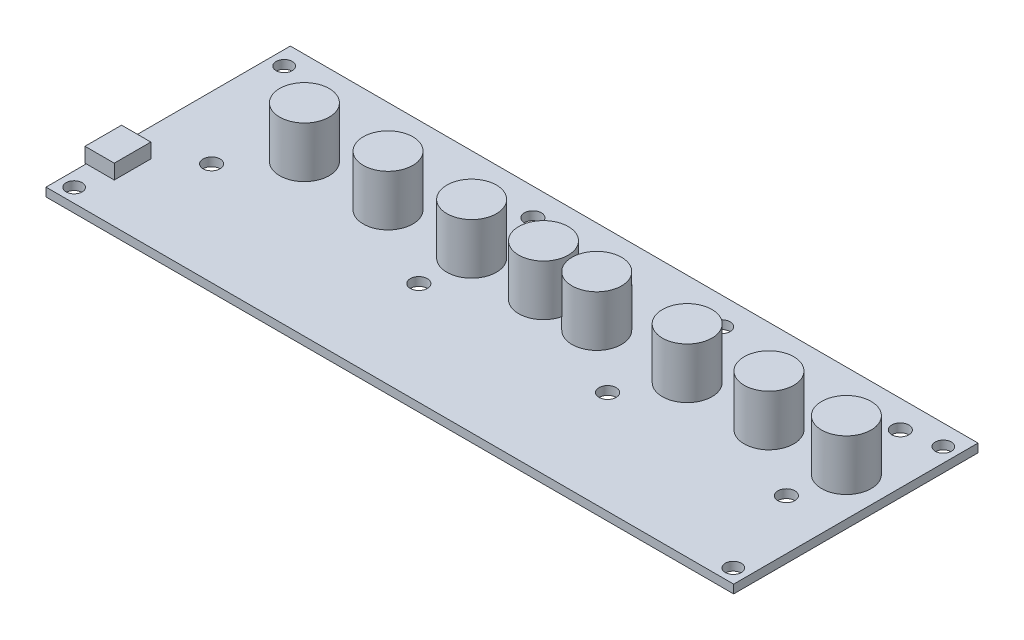
ISO-10303-21;
HEADER;
FILE_DESCRIPTION(('STEP AP214'),'2;1');
FILE_NAME('part.step','',(''),(''),'','','');
FILE_SCHEMA(('AUTOMOTIVE_DESIGN { 1 0 10303 214 1 1 1 1 }'));
ENDSEC;
DATA;
#1=APPLICATION_CONTEXT('core data for automotive mechanical design processes');
#2=APPLICATION_PROTOCOL_DEFINITION('international standard','automotive_design',2000,#1);
#3=PRODUCT_CONTEXT('',#1,'mechanical');
#4=PRODUCT('Part','Part','',(#3));
#5=PRODUCT_RELATED_PRODUCT_CATEGORY('part','',(#4));
#6=PRODUCT_DEFINITION_FORMATION('','',#4);
#7=PRODUCT_DEFINITION_CONTEXT('part definition',#1,'design');
#8=PRODUCT_DEFINITION('design','',#6,#7);
#9=PRODUCT_DEFINITION_SHAPE('','',#8);
#10=(LENGTH_UNIT() NAMED_UNIT(*) SI_UNIT(.MILLI.,.METRE.));
#11=(NAMED_UNIT(*) PLANE_ANGLE_UNIT() SI_UNIT($,.RADIAN.));
#12=(NAMED_UNIT(*) SI_UNIT($,.STERADIAN.) SOLID_ANGLE_UNIT());
#13=UNCERTAINTY_MEASURE_WITH_UNIT(LENGTH_MEASURE(1.E-05),#10,'distance_accuracy_value','');
#14=(GEOMETRIC_REPRESENTATION_CONTEXT(3) GLOBAL_UNCERTAINTY_ASSIGNED_CONTEXT((#13)) GLOBAL_UNIT_ASSIGNED_CONTEXT((#10,
#11,#12)) REPRESENTATION_CONTEXT('',''));
#15=CARTESIAN_POINT('',(0.,0.,0.));
#16=DIRECTION('',(0.,0.,1.));
#17=DIRECTION('',(1.,0.,0.));
#18=AXIS2_PLACEMENT_3D('',#15,#16,#17);
#19=CARTESIAN_POINT('',(70.5,0.875,25.05));
#20=DIRECTION('',(-1.,0.,0.));
#21=DIRECTION('',(0.,0.,1.));
#22=AXIS2_PLACEMENT_3D('',#19,#20,#21);
#23=PLANE('',#22);
#24=DIRECTION('',(0.,0.,-1.));
#25=VECTOR('',#24,1.);
#26=CARTESIAN_POINT('',(70.5,-0.875,25.05));
#27=LINE('',#26,#25);
#28=CARTESIAN_POINT('',(70.5,-0.875,25.05));
#29=VERTEX_POINT('',#28);
#30=CARTESIAN_POINT('',(70.5,-0.875,-25.05));
#31=VERTEX_POINT('',#30);
#32=EDGE_CURVE('E235',#29,#31,#27,.T.);
#33=ORIENTED_EDGE('',*,*,#32,.T.);
#34=DIRECTION('',(0.,-1.,0.));
#35=VECTOR('',#34,1.);
#36=CARTESIAN_POINT('',(70.5,0.875,-25.05));
#37=LINE('',#36,#35);
#38=CARTESIAN_POINT('',(70.5,0.875,-25.05));
#39=VERTEX_POINT('',#38);
#40=EDGE_CURVE('E261',#39,#31,#37,.T.);
#41=ORIENTED_EDGE('',*,*,#40,.F.);
#42=DIRECTION('',(0.,0.,-1.));
#43=VECTOR('',#42,1.);
#44=CARTESIAN_POINT('',(70.5,0.875,25.05));
#45=LINE('',#44,#43);
#46=CARTESIAN_POINT('',(70.5,0.875,25.05));
#47=VERTEX_POINT('',#46);
#48=EDGE_CURVE('E240',#47,#39,#45,.T.);
#49=ORIENTED_EDGE('',*,*,#48,.F.);
#50=DIRECTION('',(0.,-1.,0.));
#51=VECTOR('',#50,1.);
#52=CARTESIAN_POINT('',(70.5,0.875,25.05));
#53=LINE('',#52,#51);
#54=EDGE_CURVE('E247',#47,#29,#53,.T.);
#55=ORIENTED_EDGE('',*,*,#54,.T.);
#56=EDGE_LOOP('',(#33,#41,#49,#55));
#57=FACE_BOUND('',#56,.T.);
#58=ADVANCED_FACE('F33',(#57),#23,.F.);
#59=CARTESIAN_POINT('',(-70.5,0.875,-25.05));
#60=DIRECTION('',(0.,0.,1.));
#61=DIRECTION('',(1.,0.,0.));
#62=AXIS2_PLACEMENT_3D('',#59,#60,#61);
#63=PLANE('',#62);
#64=DIRECTION('',(-1.,0.,0.));
#65=VECTOR('',#64,1.);
#66=CARTESIAN_POINT('',(-70.5,-0.875,-25.05));
#67=LINE('',#66,#65);
#68=CARTESIAN_POINT('',(-70.5,-0.875,-25.05));
#69=VERTEX_POINT('',#68);
#70=EDGE_CURVE('E250',#31,#69,#67,.T.);
#71=ORIENTED_EDGE('',*,*,#70,.T.);
#72=DIRECTION('',(0.,-1.,0.));
#73=VECTOR('',#72,1.);
#74=CARTESIAN_POINT('',(-70.5,0.875,-25.05));
#75=LINE('',#74,#73);
#76=CARTESIAN_POINT('',(-70.5,0.875,-25.05));
#77=VERTEX_POINT('',#76);
#78=EDGE_CURVE('E258',#77,#69,#75,.T.);
#79=ORIENTED_EDGE('',*,*,#78,.F.);
#80=DIRECTION('',(-1.,0.,0.));
#81=VECTOR('',#80,1.);
#82=CARTESIAN_POINT('',(-70.5,0.875,-25.05));
#83=LINE('',#82,#81);
#84=EDGE_CURVE('E85',#39,#77,#83,.T.);
#85=ORIENTED_EDGE('',*,*,#84,.F.);
#86=ORIENTED_EDGE('',*,*,#40,.T.);
#87=EDGE_LOOP('',(#71,#79,#85,#86));
#88=FACE_BOUND('',#87,.T.);
#89=ADVANCED_FACE('F342',(#88),#63,.F.);
#90=CARTESIAN_POINT('',(-70.5,0.875,25.05));
#91=DIRECTION('',(1.,0.,0.));
#92=DIRECTION('',(0.,0.,-1.));
#93=AXIS2_PLACEMENT_3D('',#90,#91,#92);
#94=PLANE('',#93);
#95=DIRECTION('',(0.,0.,1.));
#96=VECTOR('',#95,1.);
#97=CARTESIAN_POINT('',(-70.5,-0.875,25.05));
#98=LINE('',#97,#96);
#99=CARTESIAN_POINT('',(-70.5,-0.875,25.05));
#100=VERTEX_POINT('',#99);
#101=EDGE_CURVE('E252',#69,#100,#98,.T.);
#102=ORIENTED_EDGE('',*,*,#101,.T.);
#103=DIRECTION('',(0.,-1.,0.));
#104=VECTOR('',#103,1.);
#105=CARTESIAN_POINT('',(-70.5,0.875,25.05));
#106=LINE('',#105,#104);
#107=CARTESIAN_POINT('',(-70.5,0.875,25.05));
#108=VERTEX_POINT('',#107);
#109=EDGE_CURVE('E256',#108,#100,#106,.T.);
#110=ORIENTED_EDGE('',*,*,#109,.F.);
#111=DIRECTION('',(0.,0.,1.));
#112=VECTOR('',#111,1.);
#113=CARTESIAN_POINT('',(-70.5,0.875,25.05));
#114=LINE('',#113,#112);
#115=CARTESIAN_POINT('',(-70.5,0.875,16.8));
#116=VERTEX_POINT('',#115);
#117=EDGE_CURVE('E243',#116,#108,#114,.T.);
#118=ORIENTED_EDGE('',*,*,#117,.F.);
#119=CARTESIAN_POINT('',(-70.5,0.875,9.3));
#120=VERTEX_POINT('',#119);
#121=EDGE_CURVE('E245',#120,#116,#114,.T.);
#122=ORIENTED_EDGE('',*,*,#121,.F.);
#123=EDGE_CURVE('E134',#77,#120,#114,.T.);
#124=ORIENTED_EDGE('',*,*,#123,.F.);
#125=ORIENTED_EDGE('',*,*,#78,.T.);
#126=EDGE_LOOP('',(#102,#110,#118,#122,#124,#125));
#127=FACE_BOUND('',#126,.T.);
#128=ADVANCED_FACE('F347',(#127),#94,.F.);
#129=CARTESIAN_POINT('',(-70.5,0.875,25.05));
#130=DIRECTION('',(0.,0.,-1.));
#131=DIRECTION('',(-1.,0.,0.));
#132=AXIS2_PLACEMENT_3D('',#129,#130,#131);
#133=PLANE('',#132);
#134=DIRECTION('',(1.,0.,0.));
#135=VECTOR('',#134,1.);
#136=CARTESIAN_POINT('',(-70.5,-0.875,25.05));
#137=LINE('',#136,#135);
#138=EDGE_CURVE('E77',#100,#29,#137,.T.);
#139=ORIENTED_EDGE('',*,*,#138,.T.);
#140=ORIENTED_EDGE('',*,*,#54,.F.);
#141=DIRECTION('',(1.,0.,0.));
#142=VECTOR('',#141,1.);
#143=CARTESIAN_POINT('',(-70.5,0.875,25.05));
#144=LINE('',#143,#142);
#145=EDGE_CURVE('E56',#108,#47,#144,.T.);
#146=ORIENTED_EDGE('',*,*,#145,.F.);
#147=ORIENTED_EDGE('',*,*,#109,.T.);
#148=EDGE_LOOP('',(#139,#140,#146,#147));
#149=FACE_BOUND('',#148,.T.);
#150=ADVANCED_FACE('F288',(#149),#133,.F.);
#151=CARTESIAN_POINT('',(0.,0.875,0.));
#152=DIRECTION('',(0.,-1.,0.));
#153=DIRECTION('',(0.,0.,-1.));
#154=AXIS2_PLACEMENT_3D('',#151,#152,#153);
#155=PLANE('',#154);
#156=ORIENTED_EDGE('',*,*,#123,.T.);
#157=DIRECTION('',(-1.,0.,0.));
#158=VECTOR('',#157,1.);
#159=CARTESIAN_POINT('',(-64.754,0.875,9.3));
#160=LINE('',#159,#158);
#161=CARTESIAN_POINT('',(-64.754,0.875,9.3));
#162=VERTEX_POINT('',#161);
#163=EDGE_CURVE('E125',#162,#120,#160,.T.);
#164=ORIENTED_EDGE('',*,*,#163,.F.);
#165=DIRECTION('',(0.,0.,1.));
#166=VECTOR('',#165,1.);
#167=CARTESIAN_POINT('',(-64.754,0.875,9.3));
#168=LINE('',#167,#166);
#169=CARTESIAN_POINT('',(-64.754,0.875,16.8));
#170=VERTEX_POINT('',#169);
#171=EDGE_CURVE('E113',#162,#170,#168,.T.);
#172=ORIENTED_EDGE('',*,*,#171,.T.);
#173=DIRECTION('',(-1.,0.,0.));
#174=VECTOR('',#173,1.);
#175=CARTESIAN_POINT('',(-64.754,0.875,16.8));
#176=LINE('',#175,#174);
#177=EDGE_CURVE('E138',#170,#116,#176,.T.);
#178=ORIENTED_EDGE('',*,*,#177,.T.);
#179=ORIENTED_EDGE('',*,*,#117,.T.);
#180=ORIENTED_EDGE('',*,*,#145,.T.);
#181=ORIENTED_EDGE('',*,*,#48,.T.);
#182=ORIENTED_EDGE('',*,*,#84,.T.);
#183=EDGE_LOOP('',(#156,#164,#172,#178,#179,#180,#181,#182));
#184=FACE_BOUND('',#183,.T.);
#185=CARTESIAN_POINT('',(62.5625,0.875000000000001,-6.));
#186=DIRECTION('',(0.,-1.,0.));
#187=DIRECTION('',(0.,0.,-1.));
#188=AXIS2_PLACEMENT_3D('',#185,#186,#187);
#189=CIRCLE('',#188,5.08);
#190=CARTESIAN_POINT('',(62.5625,0.875000000000001,-11.08));
#191=VERTEX_POINT('',#190);
#192=EDGE_CURVE('E11',#191,#191,#189,.F.);
#193=ORIENTED_EDGE('',*,*,#192,.F.);
#194=EDGE_LOOP('',(#193));
#195=FACE_BOUND('',#194,.T.);
#196=CARTESIAN_POINT('',(46.6875,0.875000000000001,-6.));
#197=DIRECTION('',(0.,-1.,0.));
#198=DIRECTION('',(0.,0.,-1.));
#199=AXIS2_PLACEMENT_3D('',#196,#197,#198);
#200=CIRCLE('',#199,5.08);
#201=CARTESIAN_POINT('',(46.6875,0.875000000000001,-11.08));
#202=VERTEX_POINT('',#201);
#203=EDGE_CURVE('E40',#202,#202,#200,.F.);
#204=ORIENTED_EDGE('',*,*,#203,.F.);
#205=EDGE_LOOP('',(#204));
#206=FACE_BOUND('',#205,.T.);
#207=CARTESIAN_POINT('',(29.9235,0.875000000000001,-6.));
#208=DIRECTION('',(0.,-1.,0.));
#209=DIRECTION('',(0.,0.,-1.));
#210=AXIS2_PLACEMENT_3D('',#207,#208,#209);
#211=CIRCLE('',#210,5.08);
#212=CARTESIAN_POINT('',(29.9235,0.875000000000001,-11.08));
#213=VERTEX_POINT('',#212);
#214=EDGE_CURVE('E278',#213,#213,#211,.F.);
#215=ORIENTED_EDGE('',*,*,#214,.F.);
#216=EDGE_LOOP('',(#215));
#217=FACE_BOUND('',#216,.T.);
#218=CARTESIAN_POINT('',(11.3815,0.875000000000001,-6.));
#219=DIRECTION('',(0.,-1.,0.));
#220=DIRECTION('',(0.,0.,-1.));
#221=AXIS2_PLACEMENT_3D('',#218,#219,#220);
#222=CIRCLE('',#221,5.08);
#223=CARTESIAN_POINT('',(11.3815,0.875000000000001,-11.08));
#224=VERTEX_POINT('',#223);
#225=EDGE_CURVE('E275',#224,#224,#222,.F.);
#226=ORIENTED_EDGE('',*,*,#225,.F.);
#227=EDGE_LOOP('',(#226));
#228=FACE_BOUND('',#227,.T.);
#229=CARTESIAN_POINT('',(0.459499999999993,0.875000000000001,-6.));
#230=DIRECTION('',(0.,-1.,0.));
#231=DIRECTION('',(0.,0.,-1.));
#232=AXIS2_PLACEMENT_3D('',#229,#230,#231);
#233=CIRCLE('',#232,5.08);
#234=CARTESIAN_POINT('',(0.459499999999993,0.875000000000001,-11.08));
#235=VERTEX_POINT('',#234);
#236=EDGE_CURVE('E272',#235,#235,#233,.F.);
#237=ORIENTED_EDGE('',*,*,#236,.F.);
#238=EDGE_LOOP('',(#237));
#239=FACE_BOUND('',#238,.T.);
#240=CARTESIAN_POINT('',(-14.2725,0.875000000000001,-6.));
#241=DIRECTION('',(0.,-1.,0.));
#242=DIRECTION('',(0.,0.,-1.));
#243=AXIS2_PLACEMENT_3D('',#240,#241,#242);
#244=CIRCLE('',#243,5.08);
#245=CARTESIAN_POINT('',(-14.2725,0.875000000000001,-11.08));
#246=VERTEX_POINT('',#245);
#247=EDGE_CURVE('E269',#246,#246,#244,.F.);
#248=ORIENTED_EDGE('',*,*,#247,.F.);
#249=EDGE_LOOP('',(#248));
#250=FACE_BOUND('',#249,.T.);
#251=CARTESIAN_POINT('',(-31.4175,0.875000000000001,-6.));
#252=DIRECTION('',(0.,-1.,0.));
#253=DIRECTION('',(0.,0.,-1.));
#254=AXIS2_PLACEMENT_3D('',#251,#252,#253);
#255=CIRCLE('',#254,5.08);
#256=CARTESIAN_POINT('',(-31.4175,0.875000000000001,-11.08));
#257=VERTEX_POINT('',#256);
#258=EDGE_CURVE('E266',#257,#257,#255,.F.);
#259=ORIENTED_EDGE('',*,*,#258,.F.);
#260=EDGE_LOOP('',(#259));
#261=FACE_BOUND('',#260,.T.);
#262=CARTESIAN_POINT('',(-48.5625,0.875000000000001,-6.));
#263=DIRECTION('',(0.,-1.,0.));
#264=DIRECTION('',(0.,0.,-1.));
#265=AXIS2_PLACEMENT_3D('',#262,#263,#264);
#266=CIRCLE('',#265,5.08);
#267=CARTESIAN_POINT('',(-48.5625,0.875000000000001,-11.08));
#268=VERTEX_POINT('',#267);
#269=EDGE_CURVE('E263',#268,#268,#266,.F.);
#270=ORIENTED_EDGE('',*,*,#269,.F.);
#271=EDGE_LOOP('',(#270));
#272=FACE_BOUND('',#271,.T.);
#273=CARTESIAN_POINT('',(-67.579,0.875,-20.859));
#274=DIRECTION('',(0.,-1.,0.));
#275=DIRECTION('',(0.,0.,1.));
#276=AXIS2_PLACEMENT_3D('',#273,#274,#275);
#277=CIRCLE('',#276,1.65100000000001);
#278=CARTESIAN_POINT('',(-67.579,0.875,-19.208));
#279=VERTEX_POINT('',#278);
#280=EDGE_CURVE('E168',#279,#279,#277,.T.);
#281=ORIENTED_EDGE('',*,*,#280,.T.);
#282=EDGE_LOOP('',(#281));
#283=FACE_BOUND('',#282,.T.);
#284=CARTESIAN_POINT('',(-67.579,0.875,22.199));
#285=DIRECTION('',(0.,-1.,0.));
#286=DIRECTION('',(0.,0.,1.));
#287=AXIS2_PLACEMENT_3D('',#284,#285,#286);
#288=CIRCLE('',#287,1.65100000000001);
#289=CARTESIAN_POINT('',(-67.579,0.875,23.85));
#290=VERTEX_POINT('',#289);
#291=EDGE_CURVE('E167',#290,#290,#288,.T.);
#292=ORIENTED_EDGE('',*,*,#291,.T.);
#293=EDGE_LOOP('',(#292));
#294=FACE_BOUND('',#293,.T.);
#295=CARTESIAN_POINT('',(-15.15,0.875,3.95));
#296=DIRECTION('',(0.,1.,0.));
#297=DIRECTION('',(0.,0.,1.));
#298=AXIS2_PLACEMENT_3D('',#295,#296,#297);
#299=CIRCLE('',#298,1.75000000000001);
#300=CARTESIAN_POINT('',(-15.15,0.875,5.70000000000001));
#301=VERTEX_POINT('',#300);
#302=EDGE_CURVE('E187',#301,#301,#299,.T.);
#303=ORIENTED_EDGE('',*,*,#302,.F.);
#304=EDGE_LOOP('',(#303));
#305=FACE_BOUND('',#304,.T.);
#306=CARTESIAN_POINT('',(60.2,0.875,-19.425));
#307=DIRECTION('',(0.,1.,0.));
#308=DIRECTION('',(0.,0.,1.));
#309=AXIS2_PLACEMENT_3D('',#306,#307,#308);
#310=CIRCLE('',#309,1.75);
#311=CARTESIAN_POINT('',(60.2,0.875,-17.675));
#312=VERTEX_POINT('',#311);
#313=EDGE_CURVE('E198',#312,#312,#310,.T.);
#314=ORIENTED_EDGE('',*,*,#313,.F.);
#315=EDGE_LOOP('',(#314));
#316=FACE_BOUND('',#315,.T.);
#317=CARTESIAN_POINT('',(23.55,0.875,-19.425));
#318=DIRECTION('',(0.,1.,0.));
#319=DIRECTION('',(0.,0.,1.));
#320=AXIS2_PLACEMENT_3D('',#317,#318,#319);
#321=CIRCLE('',#320,1.75);
#322=CARTESIAN_POINT('',(23.55,0.875,-17.675));
#323=VERTEX_POINT('',#322);
#324=EDGE_CURVE('E205',#323,#323,#321,.T.);
#325=ORIENTED_EDGE('',*,*,#324,.F.);
#326=EDGE_LOOP('',(#325));
#327=FACE_BOUND('',#326,.T.);
#328=CARTESIAN_POINT('',(-15.15,0.875,-19.425));
#329=DIRECTION('',(0.,1.,0.));
#330=DIRECTION('',(0.,0.,1.));
#331=AXIS2_PLACEMENT_3D('',#328,#329,#330);
#332=CIRCLE('',#331,1.75);
#333=CARTESIAN_POINT('',(-15.15,0.875,-17.675));
#334=VERTEX_POINT('',#333);
#335=EDGE_CURVE('E210',#334,#334,#332,.T.);
#336=ORIENTED_EDGE('',*,*,#335,.F.);
#337=EDGE_LOOP('',(#336));
#338=FACE_BOUND('',#337,.T.);
#339=CARTESIAN_POINT('',(23.55,0.875,3.95));
#340=DIRECTION('',(0.,1.,0.));
#341=DIRECTION('',(0.,0.,1.));
#342=AXIS2_PLACEMENT_3D('',#339,#340,#341);
#343=CIRCLE('',#342,1.75);
#344=CARTESIAN_POINT('',(23.55,0.875,5.70000000000001));
#345=VERTEX_POINT('',#344);
#346=EDGE_CURVE('E180',#345,#345,#343,.T.);
#347=ORIENTED_EDGE('',*,*,#346,.F.);
#348=EDGE_LOOP('',(#347));
#349=FACE_BOUND('',#348,.T.);
#350=CARTESIAN_POINT('',(60.2,0.875,3.95));
#351=DIRECTION('',(0.,1.,0.));
#352=DIRECTION('',(0.,0.,1.));
#353=AXIS2_PLACEMENT_3D('',#350,#351,#352);
#354=CIRCLE('',#353,1.75000000000001);
#355=CARTESIAN_POINT('',(60.2,0.875,5.70000000000001));
#356=VERTEX_POINT('',#355);
#357=EDGE_CURVE('E188',#356,#356,#354,.T.);
#358=ORIENTED_EDGE('',*,*,#357,.F.);
#359=EDGE_LOOP('',(#358));
#360=FACE_BOUND('',#359,.T.);
#361=CARTESIAN_POINT('',(-57.6499999999999,0.875,3.95));
#362=DIRECTION('',(0.,1.,0.));
#363=DIRECTION('',(0.,0.,1.));
#364=AXIS2_PLACEMENT_3D('',#361,#362,#363);
#365=CIRCLE('',#364,1.75);
#366=CARTESIAN_POINT('',(-57.6499999999999,0.875,5.70000000000001));
#367=VERTEX_POINT('',#366);
#368=EDGE_CURVE('E175',#367,#367,#365,.T.);
#369=ORIENTED_EDGE('',*,*,#368,.F.);
#370=EDGE_LOOP('',(#369));
#371=FACE_BOUND('',#370,.T.);
#372=CARTESIAN_POINT('',(-57.65,0.875,-19.425));
#373=DIRECTION('',(0.,1.,0.));
#374=DIRECTION('',(0.,0.,1.));
#375=AXIS2_PLACEMENT_3D('',#372,#373,#374);
#376=CIRCLE('',#375,1.75);
#377=CARTESIAN_POINT('',(-57.65,0.875,-17.675));
#378=VERTEX_POINT('',#377);
#379=EDGE_CURVE('E217',#378,#378,#376,.T.);
#380=ORIENTED_EDGE('',*,*,#379,.F.);
#381=EDGE_LOOP('',(#380));
#382=FACE_BOUND('',#381,.T.);
#383=CARTESIAN_POINT('',(67.579,0.875,-20.859));
#384=DIRECTION('',(0.,1.,0.));
#385=DIRECTION('',(0.,0.,1.));
#386=AXIS2_PLACEMENT_3D('',#383,#384,#385);
#387=CIRCLE('',#386,1.65100000000001);
#388=CARTESIAN_POINT('',(67.579,0.875,-19.208));
#389=VERTEX_POINT('',#388);
#390=EDGE_CURVE('E228',#389,#389,#387,.T.);
#391=ORIENTED_EDGE('',*,*,#390,.F.);
#392=EDGE_LOOP('',(#391));
#393=FACE_BOUND('',#392,.T.);
#394=CARTESIAN_POINT('',(67.579,0.875,22.199));
#395=DIRECTION('',(0.,1.,0.));
#396=DIRECTION('',(0.,0.,1.));
#397=AXIS2_PLACEMENT_3D('',#394,#395,#396);
#398=CIRCLE('',#397,1.65100000000001);
#399=CARTESIAN_POINT('',(67.579,0.875,23.85));
#400=VERTEX_POINT('',#399);
#401=EDGE_CURVE('E227',#400,#400,#398,.T.);
#402=ORIENTED_EDGE('',*,*,#401,.F.);
#403=EDGE_LOOP('',(#402));
#404=FACE_BOUND('',#403,.T.);
#405=ADVANCED_FACE('F131',(#184,#195,#206,#217,#228,#239,#250,#261,#272,#283,#294,#305,#316,
#327,#338,#349,#360,#371,#382,#393,#404),#155,.F.);
#406=CARTESIAN_POINT('',(0.,-0.875,0.));
#407=DIRECTION('',(0.,-1.,0.));
#408=DIRECTION('',(0.,0.,-1.));
#409=AXIS2_PLACEMENT_3D('',#406,#407,#408);
#410=PLANE('',#409);
#411=CARTESIAN_POINT('',(-67.579,-0.875,-20.859));
#412=DIRECTION('',(0.,-1.,0.));
#413=DIRECTION('',(0.,0.,1.));
#414=AXIS2_PLACEMENT_3D('',#411,#412,#413);
#415=CIRCLE('',#414,1.65100000000001);
#416=CARTESIAN_POINT('',(-67.579,-0.875,-19.208));
#417=VERTEX_POINT('',#416);
#418=EDGE_CURVE('E171',#417,#417,#415,.T.);
#419=ORIENTED_EDGE('',*,*,#418,.F.);
#420=EDGE_LOOP('',(#419));
#421=FACE_BOUND('',#420,.T.);
#422=CARTESIAN_POINT('',(-67.579,-0.875,22.199));
#423=DIRECTION('',(0.,-1.,0.));
#424=DIRECTION('',(0.,0.,1.));
#425=AXIS2_PLACEMENT_3D('',#422,#423,#424);
#426=CIRCLE('',#425,1.65100000000001);
#427=CARTESIAN_POINT('',(-67.579,-0.875,23.85));
#428=VERTEX_POINT('',#427);
#429=EDGE_CURVE('E172',#428,#428,#426,.T.);
#430=ORIENTED_EDGE('',*,*,#429,.F.);
#431=EDGE_LOOP('',(#430));
#432=FACE_BOUND('',#431,.T.);
#433=CARTESIAN_POINT('',(-15.15,-0.875,3.95));
#434=DIRECTION('',(0.,1.,0.));
#435=DIRECTION('',(0.,0.,1.));
#436=AXIS2_PLACEMENT_3D('',#433,#434,#435);
#437=CIRCLE('',#436,1.75000000000001);
#438=CARTESIAN_POINT('',(-15.15,-0.875,5.70000000000001));
#439=VERTEX_POINT('',#438);
#440=EDGE_CURVE('E202',#439,#439,#437,.T.);
#441=ORIENTED_EDGE('',*,*,#440,.T.);
#442=EDGE_LOOP('',(#441));
#443=FACE_BOUND('',#442,.T.);
#444=CARTESIAN_POINT('',(60.2,-0.875,-19.425));
#445=DIRECTION('',(0.,1.,0.));
#446=DIRECTION('',(0.,0.,1.));
#447=AXIS2_PLACEMENT_3D('',#444,#445,#446);
#448=CIRCLE('',#447,1.75);
#449=CARTESIAN_POINT('',(60.2,-0.875,-17.675));
#450=VERTEX_POINT('',#449);
#451=EDGE_CURVE('E201',#450,#450,#448,.T.);
#452=ORIENTED_EDGE('',*,*,#451,.T.);
#453=EDGE_LOOP('',(#452));
#454=FACE_BOUND('',#453,.T.);
#455=CARTESIAN_POINT('',(23.55,-0.875,-19.425));
#456=DIRECTION('',(0.,1.,0.));
#457=DIRECTION('',(0.,0.,1.));
#458=AXIS2_PLACEMENT_3D('',#455,#456,#457);
#459=CIRCLE('',#458,1.75);
#460=CARTESIAN_POINT('',(23.55,-0.875,-17.675));
#461=VERTEX_POINT('',#460);
#462=EDGE_CURVE('E214',#461,#461,#459,.T.);
#463=ORIENTED_EDGE('',*,*,#462,.T.);
#464=EDGE_LOOP('',(#463));
#465=FACE_BOUND('',#464,.T.);
#466=CARTESIAN_POINT('',(-15.15,-0.875,-19.425));
#467=DIRECTION('',(0.,1.,0.));
#468=DIRECTION('',(0.,0.,1.));
#469=AXIS2_PLACEMENT_3D('',#466,#467,#468);
#470=CIRCLE('',#469,1.75);
#471=CARTESIAN_POINT('',(-15.15,-0.875,-17.675));
#472=VERTEX_POINT('',#471);
#473=EDGE_CURVE('E213',#472,#472,#470,.T.);
#474=ORIENTED_EDGE('',*,*,#473,.T.);
#475=EDGE_LOOP('',(#474));
#476=FACE_BOUND('',#475,.T.);
#477=CARTESIAN_POINT('',(23.55,-0.875,3.95));
#478=DIRECTION('',(0.,1.,0.));
#479=DIRECTION('',(0.,0.,1.));
#480=AXIS2_PLACEMENT_3D('',#477,#478,#479);
#481=CIRCLE('',#480,1.75);
#482=CARTESIAN_POINT('',(23.55,-0.875,5.70000000000001));
#483=VERTEX_POINT('',#482);
#484=EDGE_CURVE('E183',#483,#483,#481,.T.);
#485=ORIENTED_EDGE('',*,*,#484,.T.);
#486=EDGE_LOOP('',(#485));
#487=FACE_BOUND('',#486,.T.);
#488=CARTESIAN_POINT('',(60.2,-0.875,3.95));
#489=DIRECTION('',(0.,1.,0.));
#490=DIRECTION('',(0.,0.,1.));
#491=AXIS2_PLACEMENT_3D('',#488,#489,#490);
#492=CIRCLE('',#491,1.75000000000001);
#493=CARTESIAN_POINT('',(60.2,-0.875,5.70000000000001));
#494=VERTEX_POINT('',#493);
#495=EDGE_CURVE('E184',#494,#494,#492,.T.);
#496=ORIENTED_EDGE('',*,*,#495,.T.);
#497=EDGE_LOOP('',(#496));
#498=FACE_BOUND('',#497,.T.);
#499=CARTESIAN_POINT('',(-57.6499999999999,-0.875,3.95));
#500=DIRECTION('',(0.,1.,0.));
#501=DIRECTION('',(0.,0.,1.));
#502=AXIS2_PLACEMENT_3D('',#499,#500,#501);
#503=CIRCLE('',#502,1.75);
#504=CARTESIAN_POINT('',(-57.6499999999999,-0.875,5.70000000000001));
#505=VERTEX_POINT('',#504);
#506=EDGE_CURVE('E191',#505,#505,#503,.T.);
#507=ORIENTED_EDGE('',*,*,#506,.T.);
#508=EDGE_LOOP('',(#507));
#509=FACE_BOUND('',#508,.T.);
#510=CARTESIAN_POINT('',(-57.65,-0.875,-19.425));
#511=DIRECTION('',(0.,1.,0.));
#512=DIRECTION('',(0.,0.,1.));
#513=AXIS2_PLACEMENT_3D('',#510,#511,#512);
#514=CIRCLE('',#513,1.75);
#515=CARTESIAN_POINT('',(-57.65,-0.875,-17.675));
#516=VERTEX_POINT('',#515);
#517=EDGE_CURVE('E224',#516,#516,#514,.T.);
#518=ORIENTED_EDGE('',*,*,#517,.T.);
#519=EDGE_LOOP('',(#518));
#520=FACE_BOUND('',#519,.T.);
#521=CARTESIAN_POINT('',(67.579,-0.875,-20.859));
#522=DIRECTION('',(0.,1.,0.));
#523=DIRECTION('',(0.,0.,1.));
#524=AXIS2_PLACEMENT_3D('',#521,#522,#523);
#525=CIRCLE('',#524,1.65100000000001);
#526=CARTESIAN_POINT('',(67.579,-0.875,-19.208));
#527=VERTEX_POINT('',#526);
#528=EDGE_CURVE('E231',#527,#527,#525,.T.);
#529=ORIENTED_EDGE('',*,*,#528,.T.);
#530=EDGE_LOOP('',(#529));
#531=FACE_BOUND('',#530,.T.);
#532=CARTESIAN_POINT('',(67.579,-0.875,22.199));
#533=DIRECTION('',(0.,1.,0.));
#534=DIRECTION('',(0.,0.,1.));
#535=AXIS2_PLACEMENT_3D('',#532,#533,#534);
#536=CIRCLE('',#535,1.65100000000001);
#537=CARTESIAN_POINT('',(67.579,-0.875,23.85));
#538=VERTEX_POINT('',#537);
#539=EDGE_CURVE('E232',#538,#538,#536,.T.);
#540=ORIENTED_EDGE('',*,*,#539,.T.);
#541=EDGE_LOOP('',(#540));
#542=FACE_BOUND('',#541,.T.);
#543=ORIENTED_EDGE('',*,*,#32,.F.);
#544=ORIENTED_EDGE('',*,*,#138,.F.);
#545=ORIENTED_EDGE('',*,*,#101,.F.);
#546=ORIENTED_EDGE('',*,*,#70,.F.);
#547=EDGE_LOOP('',(#543,#544,#545,#546));
#548=FACE_BOUND('',#547,.T.);
#549=ADVANCED_FACE('F287',(#421,#432,#443,#454,#465,#476,#487,#498,#509,#520,#531,#542,#548),
#410,.T.);
#550=CARTESIAN_POINT('',(67.579,-0.875,22.199));
#551=DIRECTION('',(0.,1.,0.));
#552=DIRECTION('',(0.,0.,1.));
#553=AXIS2_PLACEMENT_3D('',#550,#551,#552);
#554=CYLINDRICAL_SURFACE('',#553,1.65100000000001);
#555=ORIENTED_EDGE('',*,*,#539,.F.);
#556=EDGE_LOOP('',(#555));
#557=FACE_BOUND('',#556,.T.);
#558=ORIENTED_EDGE('',*,*,#401,.T.);
#559=EDGE_LOOP('',(#558));
#560=FACE_BOUND('',#559,.T.);
#561=ADVANCED_FACE('F326',(#557,#560),#554,.F.);
#562=CARTESIAN_POINT('',(67.579,-0.875,-20.859));
#563=DIRECTION('',(0.,1.,0.));
#564=DIRECTION('',(0.,0.,1.));
#565=AXIS2_PLACEMENT_3D('',#562,#563,#564);
#566=CYLINDRICAL_SURFACE('',#565,1.65100000000001);
#567=ORIENTED_EDGE('',*,*,#528,.F.);
#568=EDGE_LOOP('',(#567));
#569=FACE_BOUND('',#568,.T.);
#570=ORIENTED_EDGE('',*,*,#390,.T.);
#571=EDGE_LOOP('',(#570));
#572=FACE_BOUND('',#571,.T.);
#573=ADVANCED_FACE('F328',(#569,#572),#566,.F.);
#574=CARTESIAN_POINT('',(-57.65,-0.875,-19.425));
#575=DIRECTION('',(0.,1.,0.));
#576=DIRECTION('',(0.,0.,1.));
#577=AXIS2_PLACEMENT_3D('',#574,#575,#576);
#578=CYLINDRICAL_SURFACE('',#577,1.75);
#579=ORIENTED_EDGE('',*,*,#517,.F.);
#580=EDGE_LOOP('',(#579));
#581=FACE_BOUND('',#580,.T.);
#582=ORIENTED_EDGE('',*,*,#379,.T.);
#583=EDGE_LOOP('',(#582));
#584=FACE_BOUND('',#583,.T.);
#585=ADVANCED_FACE('F335',(#581,#584),#578,.F.);
#586=CARTESIAN_POINT('',(-57.6499999999999,-0.875,3.95));
#587=DIRECTION('',(0.,1.,0.));
#588=DIRECTION('',(0.,0.,1.));
#589=AXIS2_PLACEMENT_3D('',#586,#587,#588);
#590=CYLINDRICAL_SURFACE('',#589,1.75);
#591=ORIENTED_EDGE('',*,*,#506,.F.);
#592=EDGE_LOOP('',(#591));
#593=FACE_BOUND('',#592,.T.);
#594=ORIENTED_EDGE('',*,*,#368,.T.);
#595=EDGE_LOOP('',(#594));
#596=FACE_BOUND('',#595,.T.);
#597=ADVANCED_FACE('F399',(#593,#596),#590,.F.);
#598=CARTESIAN_POINT('',(60.2,-0.875,3.95));
#599=DIRECTION('',(0.,1.,0.));
#600=DIRECTION('',(0.,0.,1.));
#601=AXIS2_PLACEMENT_3D('',#598,#599,#600);
#602=CYLINDRICAL_SURFACE('',#601,1.75000000000001);
#603=ORIENTED_EDGE('',*,*,#495,.F.);
#604=EDGE_LOOP('',(#603));
#605=FACE_BOUND('',#604,.T.);
#606=ORIENTED_EDGE('',*,*,#357,.T.);
#607=EDGE_LOOP('',(#606));
#608=FACE_BOUND('',#607,.T.);
#609=ADVANCED_FACE('F409',(#605,#608),#602,.F.);
#610=CARTESIAN_POINT('',(23.55,-0.875,3.95));
#611=DIRECTION('',(0.,1.,0.));
#612=DIRECTION('',(0.,0.,1.));
#613=AXIS2_PLACEMENT_3D('',#610,#611,#612);
#614=CYLINDRICAL_SURFACE('',#613,1.75);
#615=ORIENTED_EDGE('',*,*,#484,.F.);
#616=EDGE_LOOP('',(#615));
#617=FACE_BOUND('',#616,.T.);
#618=ORIENTED_EDGE('',*,*,#346,.T.);
#619=EDGE_LOOP('',(#618));
#620=FACE_BOUND('',#619,.T.);
#621=ADVANCED_FACE('F419',(#617,#620),#614,.F.);
#622=CARTESIAN_POINT('',(-15.15,-0.875,-19.425));
#623=DIRECTION('',(0.,1.,0.));
#624=DIRECTION('',(0.,0.,1.));
#625=AXIS2_PLACEMENT_3D('',#622,#623,#624);
#626=CYLINDRICAL_SURFACE('',#625,1.75);
#627=ORIENTED_EDGE('',*,*,#473,.F.);
#628=EDGE_LOOP('',(#627));
#629=FACE_BOUND('',#628,.T.);
#630=ORIENTED_EDGE('',*,*,#335,.T.);
#631=EDGE_LOOP('',(#630));
#632=FACE_BOUND('',#631,.T.);
#633=ADVANCED_FACE('F429',(#629,#632),#626,.F.);
#634=CARTESIAN_POINT('',(23.55,-0.875,-19.425));
#635=DIRECTION('',(0.,1.,0.));
#636=DIRECTION('',(0.,0.,1.));
#637=AXIS2_PLACEMENT_3D('',#634,#635,#636);
#638=CYLINDRICAL_SURFACE('',#637,1.75);
#639=ORIENTED_EDGE('',*,*,#462,.F.);
#640=EDGE_LOOP('',(#639));
#641=FACE_BOUND('',#640,.T.);
#642=ORIENTED_EDGE('',*,*,#324,.T.);
#643=EDGE_LOOP('',(#642));
#644=FACE_BOUND('',#643,.T.);
#645=ADVANCED_FACE('F439',(#641,#644),#638,.F.);
#646=CARTESIAN_POINT('',(60.2,-0.875,-19.425));
#647=DIRECTION('',(0.,1.,0.));
#648=DIRECTION('',(0.,0.,1.));
#649=AXIS2_PLACEMENT_3D('',#646,#647,#648);
#650=CYLINDRICAL_SURFACE('',#649,1.75);
#651=ORIENTED_EDGE('',*,*,#451,.F.);
#652=EDGE_LOOP('',(#651));
#653=FACE_BOUND('',#652,.T.);
#654=ORIENTED_EDGE('',*,*,#313,.T.);
#655=EDGE_LOOP('',(#654));
#656=FACE_BOUND('',#655,.T.);
#657=ADVANCED_FACE('F449',(#653,#656),#650,.F.);
#658=CARTESIAN_POINT('',(-15.15,-0.875,3.95));
#659=DIRECTION('',(0.,1.,0.));
#660=DIRECTION('',(0.,0.,1.));
#661=AXIS2_PLACEMENT_3D('',#658,#659,#660);
#662=CYLINDRICAL_SURFACE('',#661,1.75000000000001);
#663=ORIENTED_EDGE('',*,*,#440,.F.);
#664=EDGE_LOOP('',(#663));
#665=FACE_BOUND('',#664,.T.);
#666=ORIENTED_EDGE('',*,*,#302,.T.);
#667=EDGE_LOOP('',(#666));
#668=FACE_BOUND('',#667,.T.);
#669=ADVANCED_FACE('F459',(#665,#668),#662,.F.);
#670=CARTESIAN_POINT('',(-67.579,-0.875,22.199));
#671=DIRECTION('',(0.,1.,0.));
#672=DIRECTION('',(0.,0.,1.));
#673=AXIS2_PLACEMENT_3D('',#670,#671,#672);
#674=CYLINDRICAL_SURFACE('',#673,1.65100000000001);
#675=ORIENTED_EDGE('',*,*,#429,.T.);
#676=EDGE_LOOP('',(#675));
#677=FACE_BOUND('',#676,.T.);
#678=ORIENTED_EDGE('',*,*,#291,.F.);
#679=EDGE_LOOP('',(#678));
#680=FACE_BOUND('',#679,.T.);
#681=ADVANCED_FACE('F469',(#677,#680),#674,.F.);
#682=CARTESIAN_POINT('',(-67.579,-0.875,-20.859));
#683=DIRECTION('',(0.,1.,0.));
#684=DIRECTION('',(0.,0.,1.));
#685=AXIS2_PLACEMENT_3D('',#682,#683,#684);
#686=CYLINDRICAL_SURFACE('',#685,1.65100000000001);
#687=ORIENTED_EDGE('',*,*,#418,.T.);
#688=EDGE_LOOP('',(#687));
#689=FACE_BOUND('',#688,.T.);
#690=ORIENTED_EDGE('',*,*,#280,.F.);
#691=EDGE_LOOP('',(#690));
#692=FACE_BOUND('',#691,.T.);
#693=ADVANCED_FACE('F484',(#689,#692),#686,.F.);
#694=CARTESIAN_POINT('',(-48.5625,11.289,-6.));
#695=DIRECTION('',(0.,-1.,0.));
#696=DIRECTION('',(0.,0.,-1.));
#697=AXIS2_PLACEMENT_3D('',#694,#695,#696);
#698=CYLINDRICAL_SURFACE('',#697,5.08);
#699=CARTESIAN_POINT('',(-48.5625,11.289,-6.));
#700=DIRECTION('',(0.,1.,0.));
#701=DIRECTION('',(0.,0.,1.));
#702=AXIS2_PLACEMENT_3D('',#699,#700,#701);
#703=CIRCLE('',#702,5.08);
#704=CARTESIAN_POINT('',(-48.5625,11.289,-0.919999999999994));
#705=VERTEX_POINT('',#704);
#706=EDGE_CURVE('E164',#705,#705,#703,.T.);
#707=ORIENTED_EDGE('',*,*,#706,.F.);
#708=EDGE_LOOP('',(#707));
#709=FACE_BOUND('',#708,.T.);
#710=ORIENTED_EDGE('',*,*,#269,.T.);
#711=EDGE_LOOP('',(#710));
#712=FACE_BOUND('',#711,.T.);
#713=ADVANCED_FACE('F494',(#709,#712),#698,.T.);
#714=CARTESIAN_POINT('',(-48.5625,11.289,-6.));
#715=DIRECTION('',(0.,1.,0.));
#716=DIRECTION('',(0.,0.,1.));
#717=AXIS2_PLACEMENT_3D('',#714,#715,#716);
#718=PLANE('',#717);
#719=ORIENTED_EDGE('',*,*,#706,.T.);
#720=EDGE_LOOP('',(#719));
#721=FACE_BOUND('',#720,.T.);
#722=ADVANCED_FACE('F504',(#721),#718,.T.);
#723=CARTESIAN_POINT('',(-31.4175,11.289,-6.));
#724=DIRECTION('',(0.,-1.,0.));
#725=DIRECTION('',(0.,0.,-1.));
#726=AXIS2_PLACEMENT_3D('',#723,#724,#725);
#727=CYLINDRICAL_SURFACE('',#726,5.08);
#728=CARTESIAN_POINT('',(-31.4175,11.289,-6.));
#729=DIRECTION('',(0.,1.,0.));
#730=DIRECTION('',(0.,0.,1.));
#731=AXIS2_PLACEMENT_3D('',#728,#729,#730);
#732=CIRCLE('',#731,5.08);
#733=CARTESIAN_POINT('',(-31.4175,11.289,-0.919999999999997));
#734=VERTEX_POINT('',#733);
#735=EDGE_CURVE('E161',#734,#734,#732,.T.);
#736=ORIENTED_EDGE('',*,*,#735,.F.);
#737=EDGE_LOOP('',(#736));
#738=FACE_BOUND('',#737,.T.);
#739=ORIENTED_EDGE('',*,*,#258,.T.);
#740=EDGE_LOOP('',(#739));
#741=FACE_BOUND('',#740,.T.);
#742=ADVANCED_FACE('F514',(#738,#741),#727,.T.);
#743=CARTESIAN_POINT('',(-31.4175,11.289,-6.));
#744=DIRECTION('',(0.,1.,0.));
#745=DIRECTION('',(0.,0.,1.));
#746=AXIS2_PLACEMENT_3D('',#743,#744,#745);
#747=PLANE('',#746);
#748=ORIENTED_EDGE('',*,*,#735,.T.);
#749=EDGE_LOOP('',(#748));
#750=FACE_BOUND('',#749,.T.);
#751=ADVANCED_FACE('F524',(#750),#747,.T.);
#752=CARTESIAN_POINT('',(-14.2725,11.289,-6.));
#753=DIRECTION('',(0.,-1.,0.));
#754=DIRECTION('',(0.,0.,-1.));
#755=AXIS2_PLACEMENT_3D('',#752,#753,#754);
#756=CYLINDRICAL_SURFACE('',#755,5.08);
#757=CARTESIAN_POINT('',(-14.2725,11.289,-6.));
#758=DIRECTION('',(0.,1.,0.));
#759=DIRECTION('',(0.,0.,1.));
#760=AXIS2_PLACEMENT_3D('',#757,#758,#759);
#761=CIRCLE('',#760,5.08);
#762=CARTESIAN_POINT('',(-14.2725,11.289,-0.919999999999997));
#763=VERTEX_POINT('',#762);
#764=EDGE_CURVE('E158',#763,#763,#761,.T.);
#765=ORIENTED_EDGE('',*,*,#764,.F.);
#766=EDGE_LOOP('',(#765));
#767=FACE_BOUND('',#766,.T.);
#768=ORIENTED_EDGE('',*,*,#247,.T.);
#769=EDGE_LOOP('',(#768));
#770=FACE_BOUND('',#769,.T.);
#771=ADVANCED_FACE('F534',(#767,#770),#756,.T.);
#772=CARTESIAN_POINT('',(-14.2725,11.289,-6.));
#773=DIRECTION('',(0.,1.,0.));
#774=DIRECTION('',(0.,0.,1.));
#775=AXIS2_PLACEMENT_3D('',#772,#773,#774);
#776=PLANE('',#775);
#777=ORIENTED_EDGE('',*,*,#764,.T.);
#778=EDGE_LOOP('',(#777));
#779=FACE_BOUND('',#778,.T.);
#780=ADVANCED_FACE('F544',(#779),#776,.T.);
#781=CARTESIAN_POINT('',(0.459499999999993,11.289,-6.));
#782=DIRECTION('',(0.,-1.,0.));
#783=DIRECTION('',(0.,0.,-1.));
#784=AXIS2_PLACEMENT_3D('',#781,#782,#783);
#785=CYLINDRICAL_SURFACE('',#784,5.08);
#786=CARTESIAN_POINT('',(0.459499999999993,11.289,-6.));
#787=DIRECTION('',(0.,1.,0.));
#788=DIRECTION('',(0.,0.,1.));
#789=AXIS2_PLACEMENT_3D('',#786,#787,#788);
#790=CIRCLE('',#789,5.08);
#791=CARTESIAN_POINT('',(0.459499999999993,11.289,-0.919999999999998));
#792=VERTEX_POINT('',#791);
#793=EDGE_CURVE('E155',#792,#792,#790,.T.);
#794=ORIENTED_EDGE('',*,*,#793,.F.);
#795=EDGE_LOOP('',(#794));
#796=FACE_BOUND('',#795,.T.);
#797=ORIENTED_EDGE('',*,*,#236,.T.);
#798=EDGE_LOOP('',(#797));
#799=FACE_BOUND('',#798,.T.);
#800=ADVANCED_FACE('F554',(#796,#799),#785,.T.);
#801=CARTESIAN_POINT('',(0.459499999999993,11.289,-6.));
#802=DIRECTION('',(0.,1.,0.));
#803=DIRECTION('',(0.,0.,1.));
#804=AXIS2_PLACEMENT_3D('',#801,#802,#803);
#805=PLANE('',#804);
#806=ORIENTED_EDGE('',*,*,#793,.T.);
#807=EDGE_LOOP('',(#806));
#808=FACE_BOUND('',#807,.T.);
#809=ADVANCED_FACE('F564',(#808),#805,.T.);
#810=CARTESIAN_POINT('',(11.3815,11.289,-6.));
#811=DIRECTION('',(0.,-1.,0.));
#812=DIRECTION('',(0.,0.,-1.));
#813=AXIS2_PLACEMENT_3D('',#810,#811,#812);
#814=CYLINDRICAL_SURFACE('',#813,5.08);
#815=CARTESIAN_POINT('',(11.3815,11.289,-6.));
#816=DIRECTION('',(0.,1.,0.));
#817=DIRECTION('',(0.,0.,1.));
#818=AXIS2_PLACEMENT_3D('',#815,#816,#817);
#819=CIRCLE('',#818,5.08);
#820=CARTESIAN_POINT('',(11.3815,11.289,-0.919999999999997));
#821=VERTEX_POINT('',#820);
#822=EDGE_CURVE('E152',#821,#821,#819,.T.);
#823=ORIENTED_EDGE('',*,*,#822,.F.);
#824=EDGE_LOOP('',(#823));
#825=FACE_BOUND('',#824,.T.);
#826=ORIENTED_EDGE('',*,*,#225,.T.);
#827=EDGE_LOOP('',(#826));
#828=FACE_BOUND('',#827,.T.);
#829=ADVANCED_FACE('F574',(#825,#828),#814,.T.);
#830=CARTESIAN_POINT('',(11.3815,11.289,-6.));
#831=DIRECTION('',(0.,1.,0.));
#832=DIRECTION('',(0.,0.,1.));
#833=AXIS2_PLACEMENT_3D('',#830,#831,#832);
#834=PLANE('',#833);
#835=ORIENTED_EDGE('',*,*,#822,.T.);
#836=EDGE_LOOP('',(#835));
#837=FACE_BOUND('',#836,.T.);
#838=ADVANCED_FACE('F584',(#837),#834,.T.);
#839=CARTESIAN_POINT('',(29.9235,11.289,-6.));
#840=DIRECTION('',(0.,-1.,0.));
#841=DIRECTION('',(0.,0.,-1.));
#842=AXIS2_PLACEMENT_3D('',#839,#840,#841);
#843=CYLINDRICAL_SURFACE('',#842,5.08);
#844=CARTESIAN_POINT('',(29.9235,11.289,-6.));
#845=DIRECTION('',(0.,1.,0.));
#846=DIRECTION('',(0.,0.,1.));
#847=AXIS2_PLACEMENT_3D('',#844,#845,#846);
#848=CIRCLE('',#847,5.08);
#849=CARTESIAN_POINT('',(29.9235,11.289,-0.919999999999994));
#850=VERTEX_POINT('',#849);
#851=EDGE_CURVE('E149',#850,#850,#848,.T.);
#852=ORIENTED_EDGE('',*,*,#851,.F.);
#853=EDGE_LOOP('',(#852));
#854=FACE_BOUND('',#853,.T.);
#855=ORIENTED_EDGE('',*,*,#214,.T.);
#856=EDGE_LOOP('',(#855));
#857=FACE_BOUND('',#856,.T.);
#858=ADVANCED_FACE('F594',(#854,#857),#843,.T.);
#859=CARTESIAN_POINT('',(29.9235,11.289,-6.));
#860=DIRECTION('',(0.,1.,0.));
#861=DIRECTION('',(0.,0.,1.));
#862=AXIS2_PLACEMENT_3D('',#859,#860,#861);
#863=PLANE('',#862);
#864=ORIENTED_EDGE('',*,*,#851,.T.);
#865=EDGE_LOOP('',(#864));
#866=FACE_BOUND('',#865,.T.);
#867=ADVANCED_FACE('F604',(#866),#863,.T.);
#868=CARTESIAN_POINT('',(46.6875,11.289,-6.));
#869=DIRECTION('',(0.,-1.,0.));
#870=DIRECTION('',(0.,0.,-1.));
#871=AXIS2_PLACEMENT_3D('',#868,#869,#870);
#872=CYLINDRICAL_SURFACE('',#871,5.08);
#873=CARTESIAN_POINT('',(46.6875,11.289,-6.));
#874=DIRECTION('',(0.,1.,0.));
#875=DIRECTION('',(0.,0.,1.));
#876=AXIS2_PLACEMENT_3D('',#873,#874,#875);
#877=CIRCLE('',#876,5.08);
#878=CARTESIAN_POINT('',(46.6875,11.289,-0.919999999999994));
#879=VERTEX_POINT('',#878);
#880=EDGE_CURVE('E146',#879,#879,#877,.T.);
#881=ORIENTED_EDGE('',*,*,#880,.F.);
#882=EDGE_LOOP('',(#881));
#883=FACE_BOUND('',#882,.T.);
#884=ORIENTED_EDGE('',*,*,#203,.T.);
#885=EDGE_LOOP('',(#884));
#886=FACE_BOUND('',#885,.T.);
#887=ADVANCED_FACE('F283',(#883,#886),#872,.T.);
#888=CARTESIAN_POINT('',(46.6875,11.289,-6.));
#889=DIRECTION('',(0.,1.,0.));
#890=DIRECTION('',(0.,0.,1.));
#891=AXIS2_PLACEMENT_3D('',#888,#889,#890);
#892=PLANE('',#891);
#893=ORIENTED_EDGE('',*,*,#880,.T.);
#894=EDGE_LOOP('',(#893));
#895=FACE_BOUND('',#894,.T.);
#896=ADVANCED_FACE('F623',(#895),#892,.T.);
#897=CARTESIAN_POINT('',(62.5625,11.289,-6.));
#898=DIRECTION('',(0.,-1.,0.));
#899=DIRECTION('',(0.,0.,-1.));
#900=AXIS2_PLACEMENT_3D('',#897,#898,#899);
#901=CYLINDRICAL_SURFACE('',#900,5.08);
#902=CARTESIAN_POINT('',(62.5625,11.289,-6.));
#903=DIRECTION('',(0.,1.,0.));
#904=DIRECTION('',(0.,0.,1.));
#905=AXIS2_PLACEMENT_3D('',#902,#903,#904);
#906=CIRCLE('',#905,5.08);
#907=CARTESIAN_POINT('',(62.5625,11.289,-0.919999999999994));
#908=VERTEX_POINT('',#907);
#909=EDGE_CURVE('E143',#908,#908,#906,.T.);
#910=ORIENTED_EDGE('',*,*,#909,.F.);
#911=EDGE_LOOP('',(#910));
#912=FACE_BOUND('',#911,.T.);
#913=ORIENTED_EDGE('',*,*,#192,.T.);
#914=EDGE_LOOP('',(#913));
#915=FACE_BOUND('',#914,.T.);
#916=ADVANCED_FACE('F633',(#912,#915),#901,.T.);
#917=CARTESIAN_POINT('',(62.5625,11.289,-6.));
#918=DIRECTION('',(0.,1.,0.));
#919=DIRECTION('',(0.,0.,1.));
#920=AXIS2_PLACEMENT_3D('',#917,#918,#919);
#921=PLANE('',#920);
#922=ORIENTED_EDGE('',*,*,#909,.T.);
#923=EDGE_LOOP('',(#922));
#924=FACE_BOUND('',#923,.T.);
#925=ADVANCED_FACE('F642',(#924),#921,.T.);
#926=CARTESIAN_POINT('',(-64.754,0.875,9.3));
#927=DIRECTION('',(0.,-1.,0.));
#928=DIRECTION('',(0.,0.,-1.));
#929=AXIS2_PLACEMENT_3D('',#926,#927,#928);
#930=PLANE('',#929);
#931=ORIENTED_EDGE('',*,*,#121,.T.);
#932=CARTESIAN_POINT('',(-70.754,0.875,16.8));
#933=VERTEX_POINT('',#932);
#934=EDGE_CURVE('E135',#116,#933,#176,.T.);
#935=ORIENTED_EDGE('',*,*,#934,.T.);
#936=DIRECTION('',(0.,0.,1.));
#937=VECTOR('',#936,1.);
#938=CARTESIAN_POINT('',(-70.754,0.875,9.3));
#939=LINE('',#938,#937);
#940=CARTESIAN_POINT('',(-70.754,0.875,9.3));
#941=VERTEX_POINT('',#940);
#942=EDGE_CURVE('E717',#941,#933,#939,.T.);
#943=ORIENTED_EDGE('',*,*,#942,.F.);
#944=EDGE_CURVE('E136',#120,#941,#160,.T.);
#945=ORIENTED_EDGE('',*,*,#944,.F.);
#946=EDGE_LOOP('',(#931,#935,#943,#945));
#947=FACE_BOUND('',#946,.T.);
#948=ADVANCED_FACE('F651',(#947),#930,.T.);
#949=CARTESIAN_POINT('',(-64.754,0.875,9.3));
#950=DIRECTION('',(0.,0.,-1.));
#951=DIRECTION('',(-1.,0.,0.));
#952=AXIS2_PLACEMENT_3D('',#949,#950,#951);
#953=PLANE('',#952);
#954=DIRECTION('',(0.,-1.,0.));
#955=VECTOR('',#954,1.);
#956=CARTESIAN_POINT('',(-70.754,0.875,9.3));
#957=LINE('',#956,#955);
#958=CARTESIAN_POINT('',(-70.754,3.875,9.3));
#959=VERTEX_POINT('',#958);
#960=EDGE_CURVE('E714',#959,#941,#957,.T.);
#961=ORIENTED_EDGE('',*,*,#960,.F.);
#962=DIRECTION('',(-1.,0.,0.));
#963=VECTOR('',#962,1.);
#964=CARTESIAN_POINT('',(-64.754,3.875,9.3));
#965=LINE('',#964,#963);
#966=CARTESIAN_POINT('',(-64.754,3.875,9.3));
#967=VERTEX_POINT('',#966);
#968=EDGE_CURVE('E127',#967,#959,#965,.T.);
#969=ORIENTED_EDGE('',*,*,#968,.F.);
#970=DIRECTION('',(0.,-1.,0.));
#971=VECTOR('',#970,1.);
#972=CARTESIAN_POINT('',(-64.754,0.875,9.3));
#973=LINE('',#972,#971);
#974=EDGE_CURVE('E116',#967,#162,#973,.T.);
#975=ORIENTED_EDGE('',*,*,#974,.T.);
#976=ORIENTED_EDGE('',*,*,#163,.T.);
#977=ORIENTED_EDGE('',*,*,#944,.T.);
#978=EDGE_LOOP('',(#961,#969,#975,#976,#977));
#979=FACE_BOUND('',#978,.T.);
#980=ADVANCED_FACE('F124',(#979),#953,.T.);
#981=CARTESIAN_POINT('',(-64.754,3.875,9.3));
#982=DIRECTION('',(0.,1.,0.));
#983=DIRECTION('',(0.,0.,1.));
#984=AXIS2_PLACEMENT_3D('',#981,#982,#983);
#985=PLANE('',#984);
#986=DIRECTION('',(0.,0.,-1.));
#987=VECTOR('',#986,1.);
#988=CARTESIAN_POINT('',(-70.754,3.875,9.3));
#989=LINE('',#988,#987);
#990=CARTESIAN_POINT('',(-70.754,3.875,16.8));
#991=VERTEX_POINT('',#990);
#992=EDGE_CURVE('E128',#991,#959,#989,.T.);
#993=ORIENTED_EDGE('',*,*,#992,.F.);
#994=DIRECTION('',(-1.,0.,0.));
#995=VECTOR('',#994,1.);
#996=CARTESIAN_POINT('',(-64.754,3.875,16.8));
#997=LINE('',#996,#995);
#998=CARTESIAN_POINT('',(-64.754,3.875,16.8));
#999=VERTEX_POINT('',#998);
#1000=EDGE_CURVE('E727',#999,#991,#997,.T.);
#1001=ORIENTED_EDGE('',*,*,#1000,.F.);
#1002=DIRECTION('',(0.,0.,-1.));
#1003=VECTOR('',#1002,1.);
#1004=CARTESIAN_POINT('',(-64.754,3.875,9.3));
#1005=LINE('',#1004,#1003);
#1006=EDGE_CURVE('E140',#999,#967,#1005,.T.);
#1007=ORIENTED_EDGE('',*,*,#1006,.T.);
#1008=ORIENTED_EDGE('',*,*,#968,.T.);
#1009=EDGE_LOOP('',(#993,#1001,#1007,#1008));
#1010=FACE_BOUND('',#1009,.T.);
#1011=ADVANCED_FACE('F667',(#1010),#985,.T.);
#1012=CARTESIAN_POINT('',(-64.754,0.875,16.8));
#1013=DIRECTION('',(0.,0.,1.));
#1014=DIRECTION('',(1.,0.,0.));
#1015=AXIS2_PLACEMENT_3D('',#1012,#1013,#1014);
#1016=PLANE('',#1015);
#1017=DIRECTION('',(0.,1.,0.));
#1018=VECTOR('',#1017,1.);
#1019=CARTESIAN_POINT('',(-70.754,0.875,16.8));
#1020=LINE('',#1019,#1018);
#1021=EDGE_CURVE('E720',#933,#991,#1020,.T.);
#1022=ORIENTED_EDGE('',*,*,#1021,.F.);
#1023=ORIENTED_EDGE('',*,*,#934,.F.);
#1024=ORIENTED_EDGE('',*,*,#177,.F.);
#1025=DIRECTION('',(0.,1.,0.));
#1026=VECTOR('',#1025,1.);
#1027=CARTESIAN_POINT('',(-64.754,0.875,16.8));
#1028=LINE('',#1027,#1026);
#1029=EDGE_CURVE('E47',#170,#999,#1028,.T.);
#1030=ORIENTED_EDGE('',*,*,#1029,.T.);
#1031=ORIENTED_EDGE('',*,*,#1000,.T.);
#1032=EDGE_LOOP('',(#1022,#1023,#1024,#1030,#1031));
#1033=FACE_BOUND('',#1032,.T.);
#1034=ADVANCED_FACE('F674',(#1033),#1016,.T.);
#1035=CARTESIAN_POINT('',(-64.754,0.,0.));
#1036=DIRECTION('',(1.,0.,0.));
#1037=DIRECTION('',(0.,0.,-1.));
#1038=AXIS2_PLACEMENT_3D('',#1035,#1036,#1037);
#1039=PLANE('',#1038);
#1040=ORIENTED_EDGE('',*,*,#974,.F.);
#1041=ORIENTED_EDGE('',*,*,#1006,.F.);
#1042=ORIENTED_EDGE('',*,*,#1029,.F.);
#1043=ORIENTED_EDGE('',*,*,#171,.F.);
#1044=EDGE_LOOP('',(#1040,#1041,#1042,#1043));
#1045=FACE_BOUND('',#1044,.T.);
#1046=ADVANCED_FACE('F115',(#1045),#1039,.T.);
#1047=CARTESIAN_POINT('',(-70.754,0.,0.));
#1048=DIRECTION('',(1.,0.,0.));
#1049=DIRECTION('',(0.,0.,-1.));
#1050=AXIS2_PLACEMENT_3D('',#1047,#1048,#1049);
#1051=PLANE('',#1050);
#1052=ORIENTED_EDGE('',*,*,#960,.T.);
#1053=ORIENTED_EDGE('',*,*,#942,.T.);
#1054=ORIENTED_EDGE('',*,*,#1021,.T.);
#1055=ORIENTED_EDGE('',*,*,#992,.T.);
#1056=EDGE_LOOP('',(#1052,#1053,#1054,#1055));
#1057=FACE_BOUND('',#1056,.T.);
#1058=ADVANCED_FACE('F689',(#1057),#1051,.F.);
#1059=CLOSED_SHELL('',(#58,#89,#128,#150,#405,#549,#561,#573,#585,#597,#609,#621,#633,#645,#657,
#669,#681,#693,#713,#722,#742,#751,#771,#780,#800,#809,#829,#838,#858,#867,#887,#896,#916,#925,
#948,#980,#1011,#1034,#1046,#1058));
#1060=MANIFOLD_SOLID_BREP('B2',#1059);
#1061=ADVANCED_BREP_SHAPE_REPRESENTATION('',(#18,#1060),#14);
#1062=SHAPE_DEFINITION_REPRESENTATION(#9,#1061);
ENDSEC;
END-ISO-10303-21;
